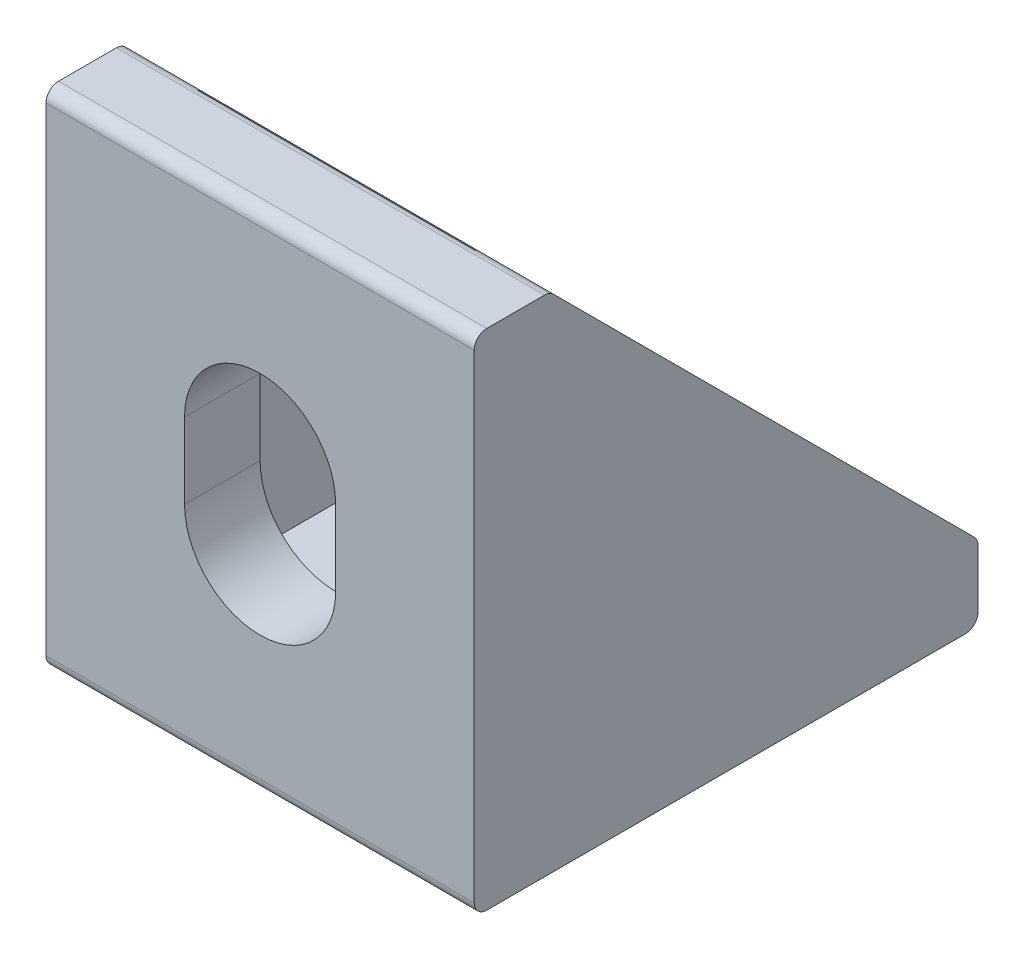
ISO-10303-21;
HEADER;
FILE_DESCRIPTION(('STEP AP214'),'2;1');
FILE_NAME('part.step','',(''),(''),'','','');
FILE_SCHEMA(('AUTOMOTIVE_DESIGN { 1 0 10303 214 1 1 1 1 }'));
ENDSEC;
DATA;
#1=APPLICATION_CONTEXT('core data for automotive mechanical design processes');
#2=APPLICATION_PROTOCOL_DEFINITION('international standard','automotive_design',2000,#1);
#3=PRODUCT_CONTEXT('',#1,'mechanical');
#4=PRODUCT('Part','Part','',(#3));
#5=PRODUCT_RELATED_PRODUCT_CATEGORY('part','',(#4));
#6=PRODUCT_DEFINITION_FORMATION('','',#4);
#7=PRODUCT_DEFINITION_CONTEXT('part definition',#1,'design');
#8=PRODUCT_DEFINITION('design','',#6,#7);
#9=PRODUCT_DEFINITION_SHAPE('','',#8);
#10=(LENGTH_UNIT() NAMED_UNIT(*) SI_UNIT(.MILLI.,.METRE.));
#11=(NAMED_UNIT(*) PLANE_ANGLE_UNIT() SI_UNIT($,.RADIAN.));
#12=(NAMED_UNIT(*) SI_UNIT($,.STERADIAN.) SOLID_ANGLE_UNIT());
#13=UNCERTAINTY_MEASURE_WITH_UNIT(LENGTH_MEASURE(1.E-05),#10,'distance_accuracy_value','');
#14=(GEOMETRIC_REPRESENTATION_CONTEXT(3) GLOBAL_UNCERTAINTY_ASSIGNED_CONTEXT((#13)) GLOBAL_UNIT_ASSIGNED_CONTEXT((#10,
#11,#12)) REPRESENTATION_CONTEXT('',''));
#15=CARTESIAN_POINT('',(0.,0.,0.));
#16=DIRECTION('',(0.,0.,1.));
#17=DIRECTION('',(1.,0.,0.));
#18=AXIS2_PLACEMENT_3D('',#15,#16,#17);
#19=CARTESIAN_POINT('',(17.,20.,-3.));
#20=DIRECTION('',(0.,-0.707106781186548,0.707106781186548));
#21=DIRECTION('',(0.,-0.707106781186548,-0.707106781186548));
#22=AXIS2_PLACEMENT_3D('',#19,#20,#21);
#23=PLANE('',#22);
#24=DIRECTION('',(0.,0.707106781186547,0.707106781186547));
#25=VECTOR('',#24,1.);
#26=CARTESIAN_POINT('',(17.,20.,-3.));
#27=LINE('',#26,#25);
#28=CARTESIAN_POINT('',(17.,3.14644660940673,-19.8535533905933));
#29=VERTEX_POINT('',#28);
#30=CARTESIAN_POINT('',(17.,19.8535533905933,-3.14644660940673));
#31=VERTEX_POINT('',#30);
#32=EDGE_CURVE('E270',#29,#31,#27,.T.);
#33=ORIENTED_EDGE('',*,*,#32,.F.);
#34=DIRECTION('',(-1.,0.,0.));
#35=VECTOR('',#34,1.);
#36=CARTESIAN_POINT('',(15.5,3.14644660940673,-19.8535533905933));
#37=LINE('',#36,#35);
#38=CARTESIAN_POINT('',(14.,3.14644660940673,-19.8535533905933));
#39=VERTEX_POINT('',#38);
#40=EDGE_CURVE('E346',#29,#39,#37,.T.);
#41=ORIENTED_EDGE('',*,*,#40,.T.);
#42=DIRECTION('',(0.,0.707106781186548,0.707106781186548));
#43=VECTOR('',#42,1.);
#44=CARTESIAN_POINT('',(14.,20.,-3.));
#45=LINE('',#44,#43);
#46=CARTESIAN_POINT('',(14.,19.8535533905933,-3.14644660940673));
#47=VERTEX_POINT('',#46);
#48=EDGE_CURVE('E326',#39,#47,#45,.T.);
#49=ORIENTED_EDGE('',*,*,#48,.T.);
#50=DIRECTION('',(-1.,0.,0.));
#51=VECTOR('',#50,1.);
#52=CARTESIAN_POINT('',(17.,19.8535533905933,-3.14644660940673));
#53=LINE('',#52,#51);
#54=EDGE_CURVE('E344',#47,#31,#53,.F.);
#55=ORIENTED_EDGE('',*,*,#54,.T.);
#56=EDGE_LOOP('',(#33,#41,#49,#55));
#57=FACE_BOUND('',#56,.T.);
#58=ADVANCED_FACE('F33',(#57),#23,.F.);
#59=DIRECTION('',(0.,-0.707106781186548,-0.707106781186548));
#60=VECTOR('',#59,1.);
#61=CARTESIAN_POINT('',(3.,20.,-3.));
#62=LINE('',#61,#60);
#63=CARTESIAN_POINT('',(3.,19.8535533905933,-3.14644660940673));
#64=VERTEX_POINT('',#63);
#65=CARTESIAN_POINT('',(3.,3.14644660940673,-19.8535533905933));
#66=VERTEX_POINT('',#65);
#67=EDGE_CURVE('E323',#64,#66,#62,.T.);
#68=ORIENTED_EDGE('',*,*,#67,.T.);
#69=DIRECTION('',(-1.,0.,0.));
#70=VECTOR('',#69,1.);
#71=CARTESIAN_POINT('',(17.,3.14644660940673,-19.8535533905933));
#72=LINE('',#71,#70);
#73=CARTESIAN_POINT('',(0.,3.14644660940673,-19.8535533905933));
#74=VERTEX_POINT('',#73);
#75=EDGE_CURVE('E331',#66,#74,#72,.T.);
#76=ORIENTED_EDGE('',*,*,#75,.T.);
#77=DIRECTION('',(0.,0.707106781186547,0.707106781186547));
#78=VECTOR('',#77,1.);
#79=CARTESIAN_POINT('',(0.,20.,-3.));
#80=LINE('',#79,#78);
#81=CARTESIAN_POINT('',(0.,19.8535533905933,-3.14644660940673));
#82=VERTEX_POINT('',#81);
#83=EDGE_CURVE('E267',#74,#82,#80,.T.);
#84=ORIENTED_EDGE('',*,*,#83,.T.);
#85=DIRECTION('',(-1.,0.,0.));
#86=VECTOR('',#85,1.);
#87=CARTESIAN_POINT('',(1.5,19.8535533905933,-3.14644660940673));
#88=LINE('',#87,#86);
#89=EDGE_CURVE('E329',#82,#64,#88,.F.);
#90=ORIENTED_EDGE('',*,*,#89,.T.);
#91=EDGE_LOOP('',(#68,#76,#84,#90));
#92=FACE_BOUND('',#91,.T.);
#93=ADVANCED_FACE('F412',(#92),#23,.F.);
#94=CARTESIAN_POINT('',(17.,20.,-3.));
#95=DIRECTION('',(0.,-1.,0.));
#96=DIRECTION('',(0.,0.,-1.));
#97=AXIS2_PLACEMENT_3D('',#94,#95,#96);
#98=PLANE('',#97);
#99=DIRECTION('',(0.,0.,1.));
#100=VECTOR('',#99,1.);
#101=CARTESIAN_POINT('',(17.,20.,-3.));
#102=LINE('',#101,#100);
#103=CARTESIAN_POINT('',(17.,20.,-2.79289321881346));
#104=VERTEX_POINT('',#103);
#105=CARTESIAN_POINT('',(17.,20.,-0.500000000000001));
#106=VERTEX_POINT('',#105);
#107=EDGE_CURVE('E273',#104,#106,#102,.T.);
#108=ORIENTED_EDGE('',*,*,#107,.F.);
#109=DIRECTION('',(-1.,0.,0.));
#110=VECTOR('',#109,1.);
#111=CARTESIAN_POINT('',(17.,20.,-2.79289321881346));
#112=LINE('',#111,#110);
#113=CARTESIAN_POINT('',(0.,20.,-2.79289321881346));
#114=VERTEX_POINT('',#113);
#115=EDGE_CURVE('E41',#104,#114,#112,.T.);
#116=ORIENTED_EDGE('',*,*,#115,.T.);
#117=DIRECTION('',(0.,0.,1.));
#118=VECTOR('',#117,1.);
#119=CARTESIAN_POINT('',(0.,20.,-3.));
#120=LINE('',#119,#118);
#121=CARTESIAN_POINT('',(0.,20.,-0.500000000000001));
#122=VERTEX_POINT('',#121);
#123=EDGE_CURVE('E292',#114,#122,#120,.T.);
#124=ORIENTED_EDGE('',*,*,#123,.T.);
#125=DIRECTION('',(-1.,0.,0.));
#126=VECTOR('',#125,1.);
#127=CARTESIAN_POINT('',(17.,20.,-0.500000000000001));
#128=LINE('',#127,#126);
#129=EDGE_CURVE('E320',#106,#122,#128,.T.);
#130=ORIENTED_EDGE('',*,*,#129,.F.);
#131=EDGE_LOOP('',(#108,#116,#124,#130));
#132=FACE_BOUND('',#131,.T.);
#133=ADVANCED_FACE('F362',(#132),#98,.F.);
#134=CARTESIAN_POINT('',(17.,19.5,-0.500000000000001));
#135=DIRECTION('',(-1.,0.,0.));
#136=DIRECTION('',(0.,0.,1.));
#137=AXIS2_PLACEMENT_3D('',#134,#135,#136);
#138=CYLINDRICAL_SURFACE('',#137,0.5);
#139=CARTESIAN_POINT('',(0.,19.5,-0.500000000000001));
#140=DIRECTION('',(1.,0.,0.));
#141=DIRECTION('',(0.,0.,1.));
#142=AXIS2_PLACEMENT_3D('',#139,#140,#141);
#143=CIRCLE('',#142,0.5);
#144=CARTESIAN_POINT('',(0.,19.5,0.));
#145=VERTEX_POINT('',#144);
#146=EDGE_CURVE('E294',#122,#145,#143,.T.);
#147=ORIENTED_EDGE('',*,*,#146,.T.);
#148=DIRECTION('',(-1.,0.,0.));
#149=VECTOR('',#148,1.);
#150=CARTESIAN_POINT('',(17.,19.5,0.));
#151=LINE('',#150,#149);
#152=CARTESIAN_POINT('',(17.,19.5,0.));
#153=VERTEX_POINT('',#152);
#154=EDGE_CURVE('E317',#153,#145,#151,.T.);
#155=ORIENTED_EDGE('',*,*,#154,.F.);
#156=CARTESIAN_POINT('',(17.,19.5,-0.500000000000001));
#157=DIRECTION('',(1.,0.,0.));
#158=DIRECTION('',(0.,0.,1.));
#159=AXIS2_PLACEMENT_3D('',#156,#157,#158);
#160=CIRCLE('',#159,0.5);
#161=EDGE_CURVE('E276',#106,#153,#160,.T.);
#162=ORIENTED_EDGE('',*,*,#161,.F.);
#163=ORIENTED_EDGE('',*,*,#129,.T.);
#164=EDGE_LOOP('',(#147,#155,#162,#163));
#165=FACE_BOUND('',#164,.T.);
#166=ADVANCED_FACE('F374',(#165),#138,.T.);
#167=CARTESIAN_POINT('',(17.,19.5,0.));
#168=DIRECTION('',(0.,0.,-1.));
#169=DIRECTION('',(0.,1.,0.));
#170=AXIS2_PLACEMENT_3D('',#167,#168,#169);
#171=PLANE('',#170);
#172=DIRECTION('',(0.,1.,0.));
#173=VECTOR('',#172,1.);
#174=CARTESIAN_POINT('',(5.5,11.4550898605622,0.));
#175=LINE('',#174,#173);
#176=CARTESIAN_POINT('',(5.5,8.45508986056223,0.));
#177=VERTEX_POINT('',#176);
#178=CARTESIAN_POINT('',(5.5,11.4550898605622,0.));
#179=VERTEX_POINT('',#178);
#180=EDGE_CURVE('E195',#177,#179,#175,.T.);
#181=ORIENTED_EDGE('',*,*,#180,.T.);
#182=CARTESIAN_POINT('',(8.5,11.4550898605622,0.));
#183=DIRECTION('',(0.,0.,-1.));
#184=DIRECTION('',(-1.,0.,0.));
#185=AXIS2_PLACEMENT_3D('',#182,#183,#184);
#186=CIRCLE('',#185,3.);
#187=CARTESIAN_POINT('',(11.5,11.4550898605622,0.));
#188=VERTEX_POINT('',#187);
#189=EDGE_CURVE('E189',#179,#188,#186,.T.);
#190=ORIENTED_EDGE('',*,*,#189,.T.);
#191=DIRECTION('',(0.,-1.,0.));
#192=VECTOR('',#191,1.);
#193=CARTESIAN_POINT('',(11.5,11.4550898605622,0.));
#194=LINE('',#193,#192);
#195=CARTESIAN_POINT('',(11.5,8.45508986056223,0.));
#196=VERTEX_POINT('',#195);
#197=EDGE_CURVE('E198',#188,#196,#194,.T.);
#198=ORIENTED_EDGE('',*,*,#197,.T.);
#199=CARTESIAN_POINT('',(8.5,8.45508986056223,0.));
#200=DIRECTION('',(0.,0.,-1.));
#201=DIRECTION('',(-1.,0.,0.));
#202=AXIS2_PLACEMENT_3D('',#199,#200,#201);
#203=CIRCLE('',#202,3.);
#204=EDGE_CURVE('E48',#196,#177,#203,.T.);
#205=ORIENTED_EDGE('',*,*,#204,.T.);
#206=EDGE_LOOP('',(#181,#190,#198,#205));
#207=FACE_BOUND('',#206,.T.);
#208=DIRECTION('',(0.,-1.,0.));
#209=VECTOR('',#208,1.);
#210=CARTESIAN_POINT('',(0.,19.5,0.));
#211=LINE('',#210,#209);
#212=CARTESIAN_POINT('',(0.,0.500000000000004,0.));
#213=VERTEX_POINT('',#212);
#214=EDGE_CURVE('E296',#145,#213,#211,.T.);
#215=ORIENTED_EDGE('',*,*,#214,.T.);
#216=DIRECTION('',(-1.,0.,0.));
#217=VECTOR('',#216,1.);
#218=CARTESIAN_POINT('',(17.,0.500000000000004,0.));
#219=LINE('',#218,#217);
#220=CARTESIAN_POINT('',(17.,0.500000000000004,0.));
#221=VERTEX_POINT('',#220);
#222=EDGE_CURVE('E314',#221,#213,#219,.T.);
#223=ORIENTED_EDGE('',*,*,#222,.F.);
#224=DIRECTION('',(0.,-1.,0.));
#225=VECTOR('',#224,1.);
#226=CARTESIAN_POINT('',(17.,19.5,0.));
#227=LINE('',#226,#225);
#228=EDGE_CURVE('E278',#153,#221,#227,.T.);
#229=ORIENTED_EDGE('',*,*,#228,.F.);
#230=ORIENTED_EDGE('',*,*,#154,.T.);
#231=EDGE_LOOP('',(#215,#223,#229,#230));
#232=FACE_BOUND('',#231,.T.);
#233=ADVANCED_FACE('F202',(#207,#232),#171,.F.);
#234=CARTESIAN_POINT('',(17.,0.5,-0.5));
#235=DIRECTION('',(-1.,0.,0.));
#236=DIRECTION('',(0.,0.,1.));
#237=AXIS2_PLACEMENT_3D('',#234,#235,#236);
#238=CYLINDRICAL_SURFACE('',#237,0.5);
#239=CARTESIAN_POINT('',(0.,0.5,-0.5));
#240=DIRECTION('',(1.,0.,0.));
#241=DIRECTION('',(0.,0.,-1.));
#242=AXIS2_PLACEMENT_3D('',#239,#240,#241);
#243=CIRCLE('',#242,0.5);
#244=CARTESIAN_POINT('',(0.,0.,-0.500000000000003));
#245=VERTEX_POINT('',#244);
#246=EDGE_CURVE('E298',#213,#245,#243,.T.);
#247=ORIENTED_EDGE('',*,*,#246,.T.);
#248=DIRECTION('',(-1.,0.,0.));
#249=VECTOR('',#248,1.);
#250=CARTESIAN_POINT('',(17.,0.,-0.500000000000003));
#251=LINE('',#250,#249);
#252=CARTESIAN_POINT('',(17.,0.,-0.500000000000003));
#253=VERTEX_POINT('',#252);
#254=EDGE_CURVE('E311',#253,#245,#251,.T.);
#255=ORIENTED_EDGE('',*,*,#254,.F.);
#256=CARTESIAN_POINT('',(17.,0.5,-0.5));
#257=DIRECTION('',(1.,0.,0.));
#258=DIRECTION('',(0.,0.,-1.));
#259=AXIS2_PLACEMENT_3D('',#256,#257,#258);
#260=CIRCLE('',#259,0.5);
#261=EDGE_CURVE('E280',#221,#253,#260,.T.);
#262=ORIENTED_EDGE('',*,*,#261,.F.);
#263=ORIENTED_EDGE('',*,*,#222,.T.);
#264=EDGE_LOOP('',(#247,#255,#262,#263));
#265=FACE_BOUND('',#264,.T.);
#266=ADVANCED_FACE('F429',(#265),#238,.T.);
#267=CARTESIAN_POINT('',(17.,0.,-0.500000000000004));
#268=DIRECTION('',(0.,1.,0.));
#269=DIRECTION('',(0.,0.,1.));
#270=AXIS2_PLACEMENT_3D('',#267,#268,#269);
#271=PLANE('',#270);
#272=DIRECTION('',(0.,0.,-1.));
#273=VECTOR('',#272,1.);
#274=CARTESIAN_POINT('',(11.5,0.,-11.4550898605622));
#275=LINE('',#274,#273);
#276=CARTESIAN_POINT('',(11.5,0.,-8.45508986056223));
#277=VERTEX_POINT('',#276);
#278=CARTESIAN_POINT('',(11.5,0.,-11.4550898605622));
#279=VERTEX_POINT('',#278);
#280=EDGE_CURVE('E234',#277,#279,#275,.T.);
#281=ORIENTED_EDGE('',*,*,#280,.T.);
#282=CARTESIAN_POINT('',(8.5,0.,-11.4550898605622));
#283=DIRECTION('',(0.,1.,0.));
#284=DIRECTION('',(0.,0.,1.));
#285=AXIS2_PLACEMENT_3D('',#282,#283,#284);
#286=CIRCLE('',#285,3.);
#287=CARTESIAN_POINT('',(5.5,0.,-11.4550898605622));
#288=VERTEX_POINT('',#287);
#289=EDGE_CURVE('E224',#279,#288,#286,.T.);
#290=ORIENTED_EDGE('',*,*,#289,.T.);
#291=DIRECTION('',(0.,0.,1.));
#292=VECTOR('',#291,1.);
#293=CARTESIAN_POINT('',(5.5,0.,-11.4550898605622));
#294=LINE('',#293,#292);
#295=CARTESIAN_POINT('',(5.5,0.,-8.45508986056223));
#296=VERTEX_POINT('',#295);
#297=EDGE_CURVE('E227',#288,#296,#294,.T.);
#298=ORIENTED_EDGE('',*,*,#297,.T.);
#299=CARTESIAN_POINT('',(8.5,0.,-8.45508986056223));
#300=DIRECTION('',(0.,1.,0.));
#301=DIRECTION('',(0.,0.,1.));
#302=AXIS2_PLACEMENT_3D('',#299,#300,#301);
#303=CIRCLE('',#302,3.);
#304=EDGE_CURVE('E231',#296,#277,#303,.T.);
#305=ORIENTED_EDGE('',*,*,#304,.T.);
#306=EDGE_LOOP('',(#281,#290,#298,#305));
#307=FACE_BOUND('',#306,.T.);
#308=DIRECTION('',(0.,0.,-1.));
#309=VECTOR('',#308,1.);
#310=CARTESIAN_POINT('',(0.,0.,-0.500000000000004));
#311=LINE('',#310,#309);
#312=CARTESIAN_POINT('',(0.,0.,-19.5));
#313=VERTEX_POINT('',#312);
#314=EDGE_CURVE('E300',#245,#313,#311,.T.);
#315=ORIENTED_EDGE('',*,*,#314,.T.);
#316=DIRECTION('',(-1.,0.,0.));
#317=VECTOR('',#316,1.);
#318=CARTESIAN_POINT('',(17.,0.,-19.5));
#319=LINE('',#318,#317);
#320=CARTESIAN_POINT('',(17.,0.,-19.5));
#321=VERTEX_POINT('',#320);
#322=EDGE_CURVE('E308',#321,#313,#319,.T.);
#323=ORIENTED_EDGE('',*,*,#322,.F.);
#324=DIRECTION('',(0.,0.,-1.));
#325=VECTOR('',#324,1.);
#326=CARTESIAN_POINT('',(17.,0.,-0.500000000000004));
#327=LINE('',#326,#325);
#328=EDGE_CURVE('E282',#253,#321,#327,.T.);
#329=ORIENTED_EDGE('',*,*,#328,.F.);
#330=ORIENTED_EDGE('',*,*,#254,.T.);
#331=EDGE_LOOP('',(#315,#323,#329,#330));
#332=FACE_BOUND('',#331,.T.);
#333=ADVANCED_FACE('F427',(#307,#332),#271,.F.);
#334=CARTESIAN_POINT('',(17.,0.5,-19.5));
#335=DIRECTION('',(-1.,0.,0.));
#336=DIRECTION('',(0.,0.,1.));
#337=AXIS2_PLACEMENT_3D('',#334,#335,#336);
#338=CYLINDRICAL_SURFACE('',#337,0.5);
#339=CARTESIAN_POINT('',(0.,0.5,-19.5));
#340=DIRECTION('',(1.,0.,0.));
#341=DIRECTION('',(0.,0.,-1.));
#342=AXIS2_PLACEMENT_3D('',#339,#340,#341);
#343=CIRCLE('',#342,0.5);
#344=CARTESIAN_POINT('',(0.,0.5,-20.));
#345=VERTEX_POINT('',#344);
#346=EDGE_CURVE('E302',#313,#345,#343,.T.);
#347=ORIENTED_EDGE('',*,*,#346,.T.);
#348=DIRECTION('',(-1.,0.,0.));
#349=VECTOR('',#348,1.);
#350=CARTESIAN_POINT('',(17.,0.5,-20.));
#351=LINE('',#350,#349);
#352=CARTESIAN_POINT('',(17.,0.5,-20.));
#353=VERTEX_POINT('',#352);
#354=EDGE_CURVE('E289',#353,#345,#351,.T.);
#355=ORIENTED_EDGE('',*,*,#354,.F.);
#356=CARTESIAN_POINT('',(17.,0.5,-19.5));
#357=DIRECTION('',(1.,0.,0.));
#358=DIRECTION('',(0.,0.,-1.));
#359=AXIS2_PLACEMENT_3D('',#356,#357,#358);
#360=CIRCLE('',#359,0.5);
#361=EDGE_CURVE('E284',#321,#353,#360,.T.);
#362=ORIENTED_EDGE('',*,*,#361,.F.);
#363=ORIENTED_EDGE('',*,*,#322,.T.);
#364=EDGE_LOOP('',(#347,#355,#362,#363));
#365=FACE_BOUND('',#364,.T.);
#366=ADVANCED_FACE('F424',(#365),#338,.T.);
#367=CARTESIAN_POINT('',(17.,0.5,-20.));
#368=DIRECTION('',(0.,0.,1.));
#369=DIRECTION('',(1.,0.,0.));
#370=AXIS2_PLACEMENT_3D('',#367,#368,#369);
#371=PLANE('',#370);
#372=DIRECTION('',(0.,1.,0.));
#373=VECTOR('',#372,1.);
#374=CARTESIAN_POINT('',(0.,0.5,-20.));
#375=LINE('',#374,#373);
#376=CARTESIAN_POINT('',(0.,2.79289321881345,-20.));
#377=VERTEX_POINT('',#376);
#378=EDGE_CURVE('E274',#345,#377,#375,.T.);
#379=ORIENTED_EDGE('',*,*,#378,.T.);
#380=DIRECTION('',(-1.,0.,0.));
#381=VECTOR('',#380,1.);
#382=CARTESIAN_POINT('',(17.,2.79289321881345,-20.));
#383=LINE('',#382,#381);
#384=CARTESIAN_POINT('',(17.,2.79289321881345,-20.));
#385=VERTEX_POINT('',#384);
#386=EDGE_CURVE('E338',#377,#385,#383,.F.);
#387=ORIENTED_EDGE('',*,*,#386,.T.);
#388=DIRECTION('',(0.,1.,0.));
#389=VECTOR('',#388,1.);
#390=CARTESIAN_POINT('',(17.,0.5,-20.));
#391=LINE('',#390,#389);
#392=EDGE_CURVE('E286',#353,#385,#391,.T.);
#393=ORIENTED_EDGE('',*,*,#392,.F.);
#394=ORIENTED_EDGE('',*,*,#354,.T.);
#395=EDGE_LOOP('',(#379,#387,#393,#394));
#396=FACE_BOUND('',#395,.T.);
#397=ADVANCED_FACE('F417',(#396),#371,.F.);
#398=CARTESIAN_POINT('',(17.,0.5,-19.5));
#399=DIRECTION('',(1.,0.,0.));
#400=DIRECTION('',(0.,0.,-1.));
#401=AXIS2_PLACEMENT_3D('',#398,#399,#400);
#402=PLANE('',#401);
#403=ORIENTED_EDGE('',*,*,#392,.T.);
#404=CARTESIAN_POINT('',(17.,2.79289321881345,-19.5));
#405=DIRECTION('',(1.,0.,0.));
#406=DIRECTION('',(0.,0.,-1.));
#407=AXIS2_PLACEMENT_3D('',#404,#405,#406);
#408=CIRCLE('',#407,0.5);
#409=EDGE_CURVE('E342',#385,#29,#408,.T.);
#410=ORIENTED_EDGE('',*,*,#409,.T.);
#411=ORIENTED_EDGE('',*,*,#32,.T.);
#412=CARTESIAN_POINT('',(17.,19.5,-2.79289321881346));
#413=DIRECTION('',(1.,0.,0.));
#414=DIRECTION('',(0.,0.,-1.));
#415=AXIS2_PLACEMENT_3D('',#412,#413,#414);
#416=CIRCLE('',#415,0.5);
#417=EDGE_CURVE('E340',#31,#104,#416,.T.);
#418=ORIENTED_EDGE('',*,*,#417,.T.);
#419=ORIENTED_EDGE('',*,*,#107,.T.);
#420=ORIENTED_EDGE('',*,*,#161,.T.);
#421=ORIENTED_EDGE('',*,*,#228,.T.);
#422=ORIENTED_EDGE('',*,*,#261,.T.);
#423=ORIENTED_EDGE('',*,*,#328,.T.);
#424=ORIENTED_EDGE('',*,*,#361,.T.);
#425=EDGE_LOOP('',(#403,#410,#411,#418,#419,#420,#421,#422,#423,#424));
#426=FACE_BOUND('',#425,.T.);
#427=ADVANCED_FACE('F380',(#426),#402,.T.);
#428=CARTESIAN_POINT('',(0.,0.5,-19.5));
#429=DIRECTION('',(1.,0.,0.));
#430=DIRECTION('',(0.,0.,-1.));
#431=AXIS2_PLACEMENT_3D('',#428,#429,#430);
#432=PLANE('',#431);
#433=ORIENTED_EDGE('',*,*,#83,.F.);
#434=CARTESIAN_POINT('',(0.,2.79289321881345,-19.5));
#435=DIRECTION('',(1.,0.,0.));
#436=DIRECTION('',(0.,0.,-1.));
#437=AXIS2_PLACEMENT_3D('',#434,#435,#436);
#438=CIRCLE('',#437,0.5);
#439=EDGE_CURVE('E336',#74,#377,#438,.F.);
#440=ORIENTED_EDGE('',*,*,#439,.T.);
#441=ORIENTED_EDGE('',*,*,#378,.F.);
#442=ORIENTED_EDGE('',*,*,#346,.F.);
#443=ORIENTED_EDGE('',*,*,#314,.F.);
#444=ORIENTED_EDGE('',*,*,#246,.F.);
#445=ORIENTED_EDGE('',*,*,#214,.F.);
#446=ORIENTED_EDGE('',*,*,#146,.F.);
#447=ORIENTED_EDGE('',*,*,#123,.F.);
#448=CARTESIAN_POINT('',(0.,19.5,-2.79289321881346));
#449=DIRECTION('',(1.,0.,0.));
#450=DIRECTION('',(0.,0.,-1.));
#451=AXIS2_PLACEMENT_3D('',#448,#449,#450);
#452=CIRCLE('',#451,0.5);
#453=EDGE_CURVE('E334',#114,#82,#452,.F.);
#454=ORIENTED_EDGE('',*,*,#453,.T.);
#455=EDGE_LOOP('',(#433,#440,#441,#442,#443,#444,#445,#446,#447,#454));
#456=FACE_BOUND('',#455,.T.);
#457=ADVANCED_FACE('F369',(#456),#432,.F.);
#458=CARTESIAN_POINT('',(14.,3.,-3.));
#459=DIRECTION('',(1.,0.,0.));
#460=DIRECTION('',(0.,0.,-1.));
#461=AXIS2_PLACEMENT_3D('',#458,#459,#460);
#462=PLANE('',#461);
#463=ORIENTED_EDGE('',*,*,#48,.F.);
#464=CARTESIAN_POINT('',(14.,2.79289321881345,-19.5));
#465=DIRECTION('',(1.,0.,0.));
#466=DIRECTION('',(0.,0.,-1.));
#467=AXIS2_PLACEMENT_3D('',#464,#465,#466);
#468=CIRCLE('',#467,0.5);
#469=CARTESIAN_POINT('',(14.,3.,-19.9550898605622));
#470=VERTEX_POINT('',#469);
#471=EDGE_CURVE('E350',#39,#470,#468,.F.);
#472=ORIENTED_EDGE('',*,*,#471,.T.);
#473=DIRECTION('',(0.,0.,-1.));
#474=VECTOR('',#473,1.);
#475=CARTESIAN_POINT('',(14.,3.,-3.));
#476=LINE('',#475,#474);
#477=CARTESIAN_POINT('',(14.,3.,-3.));
#478=VERTEX_POINT('',#477);
#479=EDGE_CURVE('E263',#478,#470,#476,.T.);
#480=ORIENTED_EDGE('',*,*,#479,.F.);
#481=DIRECTION('',(0.,-1.,0.));
#482=VECTOR('',#481,1.);
#483=CARTESIAN_POINT('',(14.,3.,-3.));
#484=LINE('',#483,#482);
#485=CARTESIAN_POINT('',(14.,19.9550898605622,-3.));
#486=VERTEX_POINT('',#485);
#487=EDGE_CURVE('E249',#486,#478,#484,.T.);
#488=ORIENTED_EDGE('',*,*,#487,.F.);
#489=CARTESIAN_POINT('',(14.,19.5,-2.79289321881346));
#490=DIRECTION('',(1.,0.,0.));
#491=DIRECTION('',(0.,0.,-1.));
#492=AXIS2_PLACEMENT_3D('',#489,#490,#491);
#493=CIRCLE('',#492,0.5);
#494=EDGE_CURVE('E348',#486,#47,#493,.F.);
#495=ORIENTED_EDGE('',*,*,#494,.T.);
#496=EDGE_LOOP('',(#463,#472,#480,#488,#495));
#497=FACE_BOUND('',#496,.T.);
#498=ADVANCED_FACE('F391',(#497),#462,.F.);
#499=CARTESIAN_POINT('',(3.,3.,-3.));
#500=DIRECTION('',(-1.,0.,0.));
#501=DIRECTION('',(0.,0.,1.));
#502=AXIS2_PLACEMENT_3D('',#499,#500,#501);
#503=PLANE('',#502);
#504=DIRECTION('',(0.,0.,-1.));
#505=VECTOR('',#504,1.);
#506=CARTESIAN_POINT('',(3.,3.,-3.));
#507=LINE('',#506,#505);
#508=CARTESIAN_POINT('',(3.,3.,-3.));
#509=VERTEX_POINT('',#508);
#510=CARTESIAN_POINT('',(3.,3.,-19.9550898605622));
#511=VERTEX_POINT('',#510);
#512=EDGE_CURVE('E264',#509,#511,#507,.T.);
#513=ORIENTED_EDGE('',*,*,#512,.T.);
#514=CARTESIAN_POINT('',(3.,2.79289321881345,-19.5));
#515=DIRECTION('',(-1.,0.,0.));
#516=DIRECTION('',(0.,0.,1.));
#517=AXIS2_PLACEMENT_3D('',#514,#515,#516);
#518=CIRCLE('',#517,0.5);
#519=EDGE_CURVE('E356',#511,#66,#518,.F.);
#520=ORIENTED_EDGE('',*,*,#519,.T.);
#521=ORIENTED_EDGE('',*,*,#67,.F.);
#522=CARTESIAN_POINT('',(3.,19.5,-2.79289321881346));
#523=DIRECTION('',(-1.,0.,0.));
#524=DIRECTION('',(0.,0.,1.));
#525=AXIS2_PLACEMENT_3D('',#522,#523,#524);
#526=CIRCLE('',#525,0.5);
#527=CARTESIAN_POINT('',(3.,19.9550898605622,-3.));
#528=VERTEX_POINT('',#527);
#529=EDGE_CURVE('E354',#64,#528,#526,.F.);
#530=ORIENTED_EDGE('',*,*,#529,.T.);
#531=DIRECTION('',(0.,1.,0.));
#532=VECTOR('',#531,1.);
#533=CARTESIAN_POINT('',(3.,3.,-3.));
#534=LINE('',#533,#532);
#535=EDGE_CURVE('E260',#509,#528,#534,.T.);
#536=ORIENTED_EDGE('',*,*,#535,.F.);
#537=EDGE_LOOP('',(#513,#520,#521,#530,#536));
#538=FACE_BOUND('',#537,.T.);
#539=ADVANCED_FACE('F405',(#538),#503,.F.);
#540=CARTESIAN_POINT('',(14.,3.,-3.));
#541=DIRECTION('',(0.,-1.,0.));
#542=DIRECTION('',(0.,0.,-1.));
#543=AXIS2_PLACEMENT_3D('',#540,#541,#542);
#544=PLANE('',#543);
#545=DIRECTION('',(0.,0.,1.));
#546=VECTOR('',#545,1.);
#547=CARTESIAN_POINT('',(5.5,3.,-11.4550898605622));
#548=LINE('',#547,#546);
#549=CARTESIAN_POINT('',(5.5,3.,-11.4550898605622));
#550=VERTEX_POINT('',#549);
#551=CARTESIAN_POINT('',(5.5,3.,-8.45508986056223));
#552=VERTEX_POINT('',#551);
#553=EDGE_CURVE('E239',#550,#552,#548,.T.);
#554=ORIENTED_EDGE('',*,*,#553,.F.);
#555=CARTESIAN_POINT('',(8.5,3.,-11.4550898605622));
#556=DIRECTION('',(0.,1.,0.));
#557=DIRECTION('',(0.,0.,1.));
#558=AXIS2_PLACEMENT_3D('',#555,#556,#557);
#559=CIRCLE('',#558,3.);
#560=CARTESIAN_POINT('',(11.5,3.,-11.4550898605622));
#561=VERTEX_POINT('',#560);
#562=EDGE_CURVE('E220',#561,#550,#559,.T.);
#563=ORIENTED_EDGE('',*,*,#562,.F.);
#564=DIRECTION('',(0.,0.,-1.));
#565=VECTOR('',#564,1.);
#566=CARTESIAN_POINT('',(11.5,3.,-11.4550898605622));
#567=LINE('',#566,#565);
#568=CARTESIAN_POINT('',(11.5,3.,-8.45508986056223));
#569=VERTEX_POINT('',#568);
#570=EDGE_CURVE('E228',#569,#561,#567,.T.);
#571=ORIENTED_EDGE('',*,*,#570,.F.);
#572=CARTESIAN_POINT('',(8.5,3.,-8.45508986056223));
#573=DIRECTION('',(0.,1.,0.));
#574=DIRECTION('',(0.,0.,1.));
#575=AXIS2_PLACEMENT_3D('',#572,#573,#574);
#576=CIRCLE('',#575,3.);
#577=EDGE_CURVE('E242',#552,#569,#576,.T.);
#578=ORIENTED_EDGE('',*,*,#577,.F.);
#579=EDGE_LOOP('',(#554,#563,#571,#578));
#580=FACE_BOUND('',#579,.T.);
#581=ORIENTED_EDGE('',*,*,#479,.T.);
#582=DIRECTION('',(-1.,0.,0.));
#583=VECTOR('',#582,1.);
#584=CARTESIAN_POINT('',(14.,3.,-19.9550898605622));
#585=LINE('',#584,#583);
#586=EDGE_CURVE('E352',#470,#511,#585,.T.);
#587=ORIENTED_EDGE('',*,*,#586,.T.);
#588=ORIENTED_EDGE('',*,*,#512,.F.);
#589=DIRECTION('',(-1.,0.,0.));
#590=VECTOR('',#589,1.);
#591=CARTESIAN_POINT('',(14.,3.,-3.));
#592=LINE('',#591,#590);
#593=EDGE_CURVE('E257',#478,#509,#592,.T.);
#594=ORIENTED_EDGE('',*,*,#593,.F.);
#595=EDGE_LOOP('',(#581,#587,#588,#594));
#596=FACE_BOUND('',#595,.T.);
#597=ADVANCED_FACE('F401',(#580,#596),#544,.F.);
#598=CARTESIAN_POINT('',(0.,0.,-3.));
#599=DIRECTION('',(0.,0.,1.));
#600=DIRECTION('',(1.,0.,0.));
#601=AXIS2_PLACEMENT_3D('',#598,#599,#600);
#602=PLANE('',#601);
#603=DIRECTION('',(0.,-1.,0.));
#604=VECTOR('',#603,1.);
#605=CARTESIAN_POINT('',(11.5,11.4550898605622,-3.));
#606=LINE('',#605,#604);
#607=CARTESIAN_POINT('',(11.5,11.4550898605622,-3.));
#608=VERTEX_POINT('',#607);
#609=CARTESIAN_POINT('',(11.5,8.45508986056223,-3.));
#610=VERTEX_POINT('',#609);
#611=EDGE_CURVE('E214',#608,#610,#606,.T.);
#612=ORIENTED_EDGE('',*,*,#611,.F.);
#613=CARTESIAN_POINT('',(8.5,11.4550898605622,-3.));
#614=DIRECTION('',(0.,0.,-1.));
#615=DIRECTION('',(-1.,0.,0.));
#616=AXIS2_PLACEMENT_3D('',#613,#614,#615);
#617=CIRCLE('',#616,3.);
#618=CARTESIAN_POINT('',(5.5,11.4550898605622,-3.));
#619=VERTEX_POINT('',#618);
#620=EDGE_CURVE('E56',#619,#608,#617,.T.);
#621=ORIENTED_EDGE('',*,*,#620,.F.);
#622=DIRECTION('',(0.,1.,0.));
#623=VECTOR('',#622,1.);
#624=CARTESIAN_POINT('',(5.5,11.4550898605622,-3.));
#625=LINE('',#624,#623);
#626=CARTESIAN_POINT('',(5.5,8.45508986056223,-3.));
#627=VERTEX_POINT('',#626);
#628=EDGE_CURVE('E205',#627,#619,#625,.T.);
#629=ORIENTED_EDGE('',*,*,#628,.F.);
#630=CARTESIAN_POINT('',(8.5,8.45508986056223,-3.));
#631=DIRECTION('',(0.,0.,-1.));
#632=DIRECTION('',(-1.,0.,0.));
#633=AXIS2_PLACEMENT_3D('',#630,#631,#632);
#634=CIRCLE('',#633,3.);
#635=EDGE_CURVE('E208',#610,#627,#634,.T.);
#636=ORIENTED_EDGE('',*,*,#635,.F.);
#637=EDGE_LOOP('',(#612,#621,#629,#636));
#638=FACE_BOUND('',#637,.T.);
#639=ORIENTED_EDGE('',*,*,#535,.T.);
#640=DIRECTION('',(-1.,0.,0.));
#641=VECTOR('',#640,1.);
#642=CARTESIAN_POINT('',(3.,19.9550898605622,-3.));
#643=LINE('',#642,#641);
#644=EDGE_CURVE('E11',#528,#486,#643,.F.);
#645=ORIENTED_EDGE('',*,*,#644,.T.);
#646=ORIENTED_EDGE('',*,*,#487,.T.);
#647=ORIENTED_EDGE('',*,*,#593,.T.);
#648=EDGE_LOOP('',(#639,#645,#646,#647));
#649=FACE_BOUND('',#648,.T.);
#650=ADVANCED_FACE('F409',(#638,#649),#602,.F.);
#651=CARTESIAN_POINT('',(17.,2.79289321881345,-19.5));
#652=DIRECTION('',(-1.,0.,0.));
#653=DIRECTION('',(0.,0.,1.));
#654=AXIS2_PLACEMENT_3D('',#651,#652,#653);
#655=CYLINDRICAL_SURFACE('',#654,0.5);
#656=ORIENTED_EDGE('',*,*,#409,.F.);
#657=ORIENTED_EDGE('',*,*,#386,.F.);
#658=ORIENTED_EDGE('',*,*,#439,.F.);
#659=ORIENTED_EDGE('',*,*,#75,.F.);
#660=ORIENTED_EDGE('',*,*,#519,.F.);
#661=ORIENTED_EDGE('',*,*,#586,.F.);
#662=ORIENTED_EDGE('',*,*,#471,.F.);
#663=ORIENTED_EDGE('',*,*,#40,.F.);
#664=EDGE_LOOP('',(#656,#657,#658,#659,#660,#661,#662,#663));
#665=FACE_BOUND('',#664,.T.);
#666=ADVANCED_FACE('F397',(#665),#655,.T.);
#667=CARTESIAN_POINT('',(17.,19.5,-2.79289321881346));
#668=DIRECTION('',(-1.,0.,0.));
#669=DIRECTION('',(0.,0.,1.));
#670=AXIS2_PLACEMENT_3D('',#667,#668,#669);
#671=CYLINDRICAL_SURFACE('',#670,0.5);
#672=ORIENTED_EDGE('',*,*,#417,.F.);
#673=ORIENTED_EDGE('',*,*,#54,.F.);
#674=ORIENTED_EDGE('',*,*,#494,.F.);
#675=ORIENTED_EDGE('',*,*,#644,.F.);
#676=ORIENTED_EDGE('',*,*,#529,.F.);
#677=ORIENTED_EDGE('',*,*,#89,.F.);
#678=ORIENTED_EDGE('',*,*,#453,.F.);
#679=ORIENTED_EDGE('',*,*,#115,.F.);
#680=EDGE_LOOP('',(#672,#673,#674,#675,#676,#677,#678,#679));
#681=FACE_BOUND('',#680,.T.);
#682=ADVANCED_FACE('F35',(#681),#671,.T.);
#683=CARTESIAN_POINT('',(8.5,0.,-11.4550898605622));
#684=DIRECTION('',(0.,1.,0.));
#685=DIRECTION('',(0.,0.,1.));
#686=AXIS2_PLACEMENT_3D('',#683,#684,#685);
#687=CYLINDRICAL_SURFACE('',#686,3.);
#688=ORIENTED_EDGE('',*,*,#562,.T.);
#689=DIRECTION('',(0.,1.,0.));
#690=VECTOR('',#689,1.);
#691=CARTESIAN_POINT('',(5.5,0.,-11.4550898605622));
#692=LINE('',#691,#690);
#693=EDGE_CURVE('E237',#288,#550,#692,.T.);
#694=ORIENTED_EDGE('',*,*,#693,.F.);
#695=ORIENTED_EDGE('',*,*,#289,.F.);
#696=DIRECTION('',(0.,1.,0.));
#697=VECTOR('',#696,1.);
#698=CARTESIAN_POINT('',(11.5,0.,-11.4550898605622));
#699=LINE('',#698,#697);
#700=EDGE_CURVE('E247',#279,#561,#699,.T.);
#701=ORIENTED_EDGE('',*,*,#700,.T.);
#702=EDGE_LOOP('',(#688,#694,#695,#701));
#703=FACE_BOUND('',#702,.T.);
#704=ADVANCED_FACE('F451',(#703),#687,.F.);
#705=CARTESIAN_POINT('',(11.5,0.,-11.4550898605622));
#706=DIRECTION('',(1.,0.,0.));
#707=DIRECTION('',(0.,0.,-1.));
#708=AXIS2_PLACEMENT_3D('',#705,#706,#707);
#709=PLANE('',#708);
#710=ORIENTED_EDGE('',*,*,#570,.T.);
#711=ORIENTED_EDGE('',*,*,#700,.F.);
#712=ORIENTED_EDGE('',*,*,#280,.F.);
#713=DIRECTION('',(0.,1.,0.));
#714=VECTOR('',#713,1.);
#715=CARTESIAN_POINT('',(11.5,0.,-8.45508986056223));
#716=LINE('',#715,#714);
#717=EDGE_CURVE('E250',#277,#569,#716,.T.);
#718=ORIENTED_EDGE('',*,*,#717,.T.);
#719=EDGE_LOOP('',(#710,#711,#712,#718));
#720=FACE_BOUND('',#719,.T.);
#721=ADVANCED_FACE('F515',(#720),#709,.F.);
#722=CARTESIAN_POINT('',(8.5,0.,-8.45508986056223));
#723=DIRECTION('',(0.,1.,0.));
#724=DIRECTION('',(0.,0.,1.));
#725=AXIS2_PLACEMENT_3D('',#722,#723,#724);
#726=CYLINDRICAL_SURFACE('',#725,3.);
#727=ORIENTED_EDGE('',*,*,#577,.T.);
#728=ORIENTED_EDGE('',*,*,#717,.F.);
#729=ORIENTED_EDGE('',*,*,#304,.F.);
#730=DIRECTION('',(0.,1.,0.));
#731=VECTOR('',#730,1.);
#732=CARTESIAN_POINT('',(5.5,0.,-8.45508986056223));
#733=LINE('',#732,#731);
#734=EDGE_CURVE('E252',#296,#552,#733,.T.);
#735=ORIENTED_EDGE('',*,*,#734,.T.);
#736=EDGE_LOOP('',(#727,#728,#729,#735));
#737=FACE_BOUND('',#736,.T.);
#738=ADVANCED_FACE('F525',(#737),#726,.F.);
#739=CARTESIAN_POINT('',(5.5,0.,-11.4550898605622));
#740=DIRECTION('',(-1.,0.,0.));
#741=DIRECTION('',(0.,0.,1.));
#742=AXIS2_PLACEMENT_3D('',#739,#740,#741);
#743=PLANE('',#742);
#744=ORIENTED_EDGE('',*,*,#553,.T.);
#745=ORIENTED_EDGE('',*,*,#734,.F.);
#746=ORIENTED_EDGE('',*,*,#297,.F.);
#747=ORIENTED_EDGE('',*,*,#693,.T.);
#748=EDGE_LOOP('',(#744,#745,#746,#747));
#749=FACE_BOUND('',#748,.T.);
#750=ADVANCED_FACE('F535',(#749),#743,.F.);
#751=CARTESIAN_POINT('',(8.5,11.4550898605622,0.));
#752=DIRECTION('',(0.,0.,-1.));
#753=DIRECTION('',(-1.,0.,0.));
#754=AXIS2_PLACEMENT_3D('',#751,#752,#753);
#755=CYLINDRICAL_SURFACE('',#754,3.);
#756=ORIENTED_EDGE('',*,*,#620,.T.);
#757=DIRECTION('',(0.,0.,-1.));
#758=VECTOR('',#757,1.);
#759=CARTESIAN_POINT('',(11.5,11.4550898605622,0.));
#760=LINE('',#759,#758);
#761=EDGE_CURVE('E185',#188,#608,#760,.T.);
#762=ORIENTED_EDGE('',*,*,#761,.F.);
#763=ORIENTED_EDGE('',*,*,#189,.F.);
#764=DIRECTION('',(0.,0.,-1.));
#765=VECTOR('',#764,1.);
#766=CARTESIAN_POINT('',(5.5,11.4550898605622,0.));
#767=LINE('',#766,#765);
#768=EDGE_CURVE('E218',#179,#619,#767,.T.);
#769=ORIENTED_EDGE('',*,*,#768,.T.);
#770=EDGE_LOOP('',(#756,#762,#763,#769));
#771=FACE_BOUND('',#770,.T.);
#772=ADVANCED_FACE('F187',(#771),#755,.F.);
#773=CARTESIAN_POINT('',(5.5,11.4550898605622,0.));
#774=DIRECTION('',(-1.,0.,0.));
#775=DIRECTION('',(0.,-1.,0.));
#776=AXIS2_PLACEMENT_3D('',#773,#774,#775);
#777=PLANE('',#776);
#778=ORIENTED_EDGE('',*,*,#628,.T.);
#779=ORIENTED_EDGE('',*,*,#768,.F.);
#780=ORIENTED_EDGE('',*,*,#180,.F.);
#781=DIRECTION('',(0.,0.,-1.));
#782=VECTOR('',#781,1.);
#783=CARTESIAN_POINT('',(5.5,8.45508986056223,0.));
#784=LINE('',#783,#782);
#785=EDGE_CURVE('E221',#177,#627,#784,.T.);
#786=ORIENTED_EDGE('',*,*,#785,.T.);
#787=EDGE_LOOP('',(#778,#779,#780,#786));
#788=FACE_BOUND('',#787,.T.);
#789=ADVANCED_FACE('F566',(#788),#777,.F.);
#790=CARTESIAN_POINT('',(8.5,8.45508986056223,0.));
#791=DIRECTION('',(0.,0.,-1.));
#792=DIRECTION('',(-1.,0.,0.));
#793=AXIS2_PLACEMENT_3D('',#790,#791,#792);
#794=CYLINDRICAL_SURFACE('',#793,3.);
#795=ORIENTED_EDGE('',*,*,#635,.T.);
#796=ORIENTED_EDGE('',*,*,#785,.F.);
#797=ORIENTED_EDGE('',*,*,#204,.F.);
#798=DIRECTION('',(0.,0.,-1.));
#799=VECTOR('',#798,1.);
#800=CARTESIAN_POINT('',(11.5,8.45508986056223,0.));
#801=LINE('',#800,#799);
#802=EDGE_CURVE('E194',#196,#610,#801,.T.);
#803=ORIENTED_EDGE('',*,*,#802,.T.);
#804=EDGE_LOOP('',(#795,#796,#797,#803));
#805=FACE_BOUND('',#804,.T.);
#806=ADVANCED_FACE('F575',(#805),#794,.F.);
#807=CARTESIAN_POINT('',(11.5,11.4550898605622,0.));
#808=DIRECTION('',(1.,0.,0.));
#809=DIRECTION('',(0.,0.,-1.));
#810=AXIS2_PLACEMENT_3D('',#807,#808,#809);
#811=PLANE('',#810);
#812=ORIENTED_EDGE('',*,*,#611,.T.);
#813=ORIENTED_EDGE('',*,*,#802,.F.);
#814=ORIENTED_EDGE('',*,*,#197,.F.);
#815=ORIENTED_EDGE('',*,*,#761,.T.);
#816=EDGE_LOOP('',(#812,#813,#814,#815));
#817=FACE_BOUND('',#816,.T.);
#818=ADVANCED_FACE('F199',(#817),#811,.F.);
#819=CLOSED_SHELL('',(#58,#93,#133,#166,#233,#266,#333,#366,#397,#427,#457,#498,#539,#597,#650,
#666,#682,#704,#721,#738,#750,#772,#789,#806,#818));
#820=MANIFOLD_SOLID_BREP('B2',#819);
#821=ADVANCED_BREP_SHAPE_REPRESENTATION('',(#18,#820),#14);
#822=SHAPE_DEFINITION_REPRESENTATION(#9,#821);
ENDSEC;
END-ISO-10303-21;
